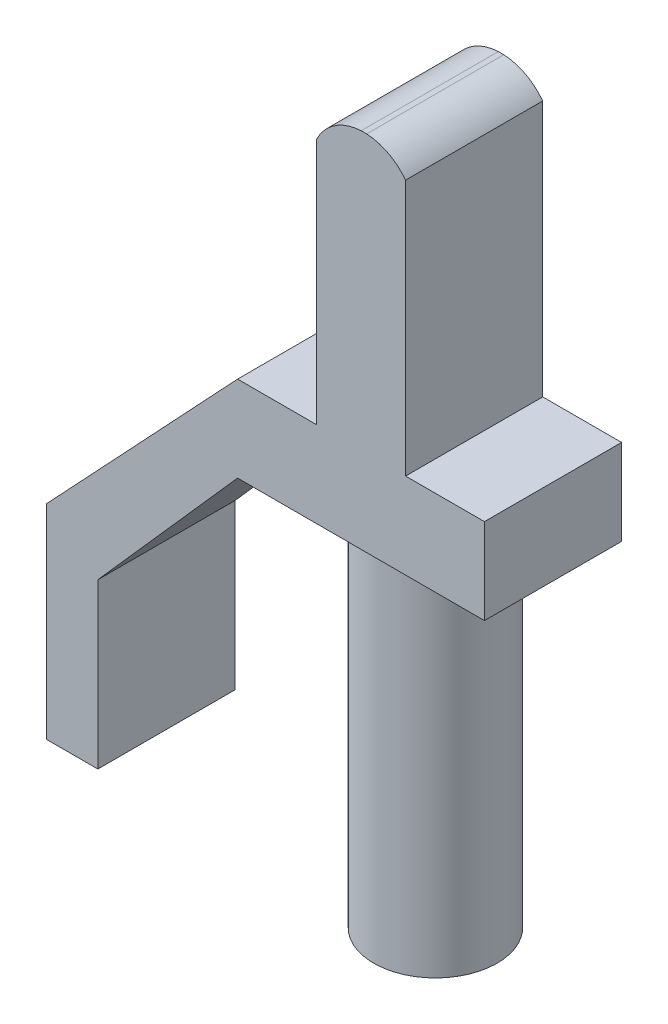
ISO-10303-21;
HEADER;
FILE_DESCRIPTION(('STEP AP214'),'2;1');
FILE_NAME('part.step','',(''),(''),'','','');
FILE_SCHEMA(('AUTOMOTIVE_DESIGN { 1 0 10303 214 1 1 1 1 }'));
ENDSEC;
DATA;
#1=APPLICATION_CONTEXT('core data for automotive mechanical design processes');
#2=APPLICATION_PROTOCOL_DEFINITION('international standard','automotive_design',2000,#1);
#3=PRODUCT_CONTEXT('',#1,'mechanical');
#4=PRODUCT('Part','Part','',(#3));
#5=PRODUCT_RELATED_PRODUCT_CATEGORY('part','',(#4));
#6=PRODUCT_DEFINITION_FORMATION('','',#4);
#7=PRODUCT_DEFINITION_CONTEXT('part definition',#1,'design');
#8=PRODUCT_DEFINITION('design','',#6,#7);
#9=PRODUCT_DEFINITION_SHAPE('','',#8);
#10=(LENGTH_UNIT() NAMED_UNIT(*) SI_UNIT(.MILLI.,.METRE.));
#11=(NAMED_UNIT(*) PLANE_ANGLE_UNIT() SI_UNIT($,.RADIAN.));
#12=(NAMED_UNIT(*) SI_UNIT($,.STERADIAN.) SOLID_ANGLE_UNIT());
#13=UNCERTAINTY_MEASURE_WITH_UNIT(LENGTH_MEASURE(1.E-05),#10,'distance_accuracy_value','');
#14=(GEOMETRIC_REPRESENTATION_CONTEXT(3) GLOBAL_UNCERTAINTY_ASSIGNED_CONTEXT((#13)) GLOBAL_UNIT_ASSIGNED_CONTEXT((#10,
#11,#12)) REPRESENTATION_CONTEXT('',''));
#15=CARTESIAN_POINT('',(0.,0.,0.));
#16=DIRECTION('',(0.,0.,1.));
#17=DIRECTION('',(1.,0.,0.));
#18=AXIS2_PLACEMENT_3D('',#15,#16,#17);
#19=CARTESIAN_POINT('',(-10.4086705744713,3.57642658835965,4.));
#20=DIRECTION('',(1.,0.,0.));
#21=DIRECTION('',(0.,0.,-1.));
#22=AXIS2_PLACEMENT_3D('',#19,#20,#21);
#23=PLANE('',#22);
#24=DIRECTION('',(0.,-1.,0.));
#25=VECTOR('',#24,1.);
#26=CARTESIAN_POINT('',(-10.4086705744713,3.57642658835965,0.));
#27=LINE('',#26,#25);
#28=CARTESIAN_POINT('',(-10.4086705744713,10.7764265883597,0.));
#29=VERTEX_POINT('',#28);
#30=CARTESIAN_POINT('',(-10.4086705744713,3.57996049213369,0.));
#31=VERTEX_POINT('',#30);
#32=EDGE_CURVE('E232',#29,#31,#27,.T.);
#33=ORIENTED_EDGE('',*,*,#32,.T.);
#34=DIRECTION('',(0.,0.,1.));
#35=VECTOR('',#34,1.);
#36=CARTESIAN_POINT('',(-10.4086705744713,3.57996049213369,4.));
#37=LINE('',#36,#35);
#38=CARTESIAN_POINT('',(-10.4086705744713,3.57996049213369,4.));
#39=VERTEX_POINT('',#38);
#40=EDGE_CURVE('E229',#31,#39,#37,.T.);
#41=ORIENTED_EDGE('',*,*,#40,.T.);
#42=DIRECTION('',(0.,-1.,0.));
#43=VECTOR('',#42,1.);
#44=CARTESIAN_POINT('',(-10.4086705744713,3.57642658835965,4.));
#45=LINE('',#44,#43);
#46=CARTESIAN_POINT('',(-10.4086705744713,10.7764265883597,4.));
#47=VERTEX_POINT('',#46);
#48=EDGE_CURVE('E233',#47,#39,#45,.T.);
#49=ORIENTED_EDGE('',*,*,#48,.F.);
#50=DIRECTION('',(0.,0.,-1.));
#51=VECTOR('',#50,1.);
#52=CARTESIAN_POINT('',(-10.4086705744713,10.7764265883597,4.));
#53=LINE('',#52,#51);
#54=EDGE_CURVE('E241',#47,#29,#53,.T.);
#55=ORIENTED_EDGE('',*,*,#54,.T.);
#56=EDGE_LOOP('',(#33,#41,#49,#55));
#57=FACE_BOUND('',#56,.T.);
#58=ADVANCED_FACE('F36',(#57),#23,.F.);
#59=CARTESIAN_POINT('',(-7.80867057447134,3.57642658835966,4.));
#60=DIRECTION('',(-1.,0.,0.));
#61=DIRECTION('',(0.,-1.,0.));
#62=AXIS2_PLACEMENT_3D('',#59,#60,#61);
#63=PLANE('',#62);
#64=DIRECTION('',(0.,1.,0.));
#65=VECTOR('',#64,1.);
#66=CARTESIAN_POINT('',(-7.80867057447134,3.57642658835966,4.));
#67=LINE('',#66,#65);
#68=CARTESIAN_POINT('',(-7.80867057447134,3.57996049213369,4.));
#69=VERTEX_POINT('',#68);
#70=CARTESIAN_POINT('',(-7.80867057447133,11.0550366767926,4.));
#71=VERTEX_POINT('',#70);
#72=EDGE_CURVE('E84',#69,#71,#67,.T.);
#73=ORIENTED_EDGE('',*,*,#72,.F.);
#74=DIRECTION('',(0.,0.,-1.));
#75=VECTOR('',#74,1.);
#76=CARTESIAN_POINT('',(-7.80867057447134,3.57996049213369,4.));
#77=LINE('',#76,#75);
#78=CARTESIAN_POINT('',(-7.80867057447134,3.57996049213369,0.));
#79=VERTEX_POINT('',#78);
#80=EDGE_CURVE('E220',#69,#79,#77,.T.);
#81=ORIENTED_EDGE('',*,*,#80,.T.);
#82=DIRECTION('',(0.,1.,0.));
#83=VECTOR('',#82,1.);
#84=CARTESIAN_POINT('',(-7.80867057447134,3.57642658835966,0.));
#85=LINE('',#84,#83);
#86=CARTESIAN_POINT('',(-7.80867057447133,11.0550366767926,0.));
#87=VERTEX_POINT('',#86);
#88=EDGE_CURVE('E244',#79,#87,#85,.T.);
#89=ORIENTED_EDGE('',*,*,#88,.T.);
#90=DIRECTION('',(0.,0.,-1.));
#91=VECTOR('',#90,1.);
#92=CARTESIAN_POINT('',(-7.80867057447133,11.0550366767926,4.));
#93=LINE('',#92,#91);
#94=EDGE_CURVE('E11',#71,#87,#93,.T.);
#95=ORIENTED_EDGE('',*,*,#94,.F.);
#96=EDGE_LOOP('',(#73,#81,#89,#95));
#97=FACE_BOUND('',#96,.T.);
#98=ADVANCED_FACE('F279',(#97),#63,.F.);
#99=CARTESIAN_POINT('',(-9.02437057447133,10.129040808734,4.));
#100=DIRECTION('',(0.,0.,-1.));
#101=DIRECTION('',(-1.,0.,0.));
#102=AXIS2_PLACEMENT_3D('',#99,#100,#101);
#103=CYLINDRICAL_SURFACE('',#102,1.52819986836195);
#104=CARTESIAN_POINT('',(-9.02437057447133,10.129040808734,0.));
#105=DIRECTION('',(0.,0.,1.));
#106=DIRECTION('',(-1.,0.,0.));
#107=AXIS2_PLACEMENT_3D('',#104,#105,#106);
#108=CIRCLE('',#107,1.52819986836195);
#109=CARTESIAN_POINT('',(-8.94482326092045,11.6551689365688,0.));
#110=VERTEX_POINT('',#109);
#111=EDGE_CURVE('E246',#87,#110,#108,.T.);
#112=ORIENTED_EDGE('',*,*,#111,.T.);
#113=DIRECTION('',(0.,0.,-1.));
#114=VECTOR('',#113,1.);
#115=CARTESIAN_POINT('',(-8.94482326092045,11.6551689365688,4.));
#116=LINE('',#115,#114);
#117=CARTESIAN_POINT('',(-8.94482326092045,11.6551689365688,4.));
#118=VERTEX_POINT('',#117);
#119=EDGE_CURVE('E43',#118,#110,#116,.T.);
#120=ORIENTED_EDGE('',*,*,#119,.F.);
#121=CARTESIAN_POINT('',(-9.02437057447133,10.129040808734,4.));
#122=DIRECTION('',(0.,0.,1.));
#123=DIRECTION('',(-1.,0.,0.));
#124=AXIS2_PLACEMENT_3D('',#121,#122,#123);
#125=CIRCLE('',#124,1.52819986836195);
#126=EDGE_CURVE('E236',#71,#118,#125,.T.);
#127=ORIENTED_EDGE('',*,*,#126,.F.);
#128=ORIENTED_EDGE('',*,*,#94,.T.);
#129=EDGE_LOOP('',(#112,#120,#127,#128));
#130=FACE_BOUND('',#129,.T.);
#131=ADVANCED_FACE('F275',(#130),#103,.T.);
#132=CARTESIAN_POINT('',(-9.10391788802218,11.6551689365688,4.));
#133=DIRECTION('',(0.,-1.,0.));
#134=DIRECTION('',(1.,0.,0.));
#135=AXIS2_PLACEMENT_3D('',#132,#133,#134);
#136=PLANE('',#135);
#137=DIRECTION('',(-1.,0.,0.));
#138=VECTOR('',#137,1.);
#139=CARTESIAN_POINT('',(-9.10391788802218,11.6551689365688,0.));
#140=LINE('',#139,#138);
#141=CARTESIAN_POINT('',(-9.10391788802218,11.6551689365688,0.));
#142=VERTEX_POINT('',#141);
#143=EDGE_CURVE('E248',#110,#142,#140,.T.);
#144=ORIENTED_EDGE('',*,*,#143,.T.);
#145=DIRECTION('',(0.,0.,-1.));
#146=VECTOR('',#145,1.);
#147=CARTESIAN_POINT('',(-9.10391788802218,11.6551689365688,4.));
#148=LINE('',#147,#146);
#149=CARTESIAN_POINT('',(-9.10391788802218,11.6551689365688,4.));
#150=VERTEX_POINT('',#149);
#151=EDGE_CURVE('E252',#150,#142,#148,.T.);
#152=ORIENTED_EDGE('',*,*,#151,.F.);
#153=DIRECTION('',(-1.,0.,0.));
#154=VECTOR('',#153,1.);
#155=CARTESIAN_POINT('',(-9.10391788802218,11.6551689365688,4.));
#156=LINE('',#155,#154);
#157=EDGE_CURVE('E238',#118,#150,#156,.T.);
#158=ORIENTED_EDGE('',*,*,#157,.F.);
#159=ORIENTED_EDGE('',*,*,#119,.T.);
#160=EDGE_LOOP('',(#144,#152,#158,#159));
#161=FACE_BOUND('',#160,.T.);
#162=ADVANCED_FACE('F258',(#161),#136,.F.);
#163=CARTESIAN_POINT('',(-9.02437057447133,10.129040808734,4.));
#164=DIRECTION('',(0.,0.,-1.));
#165=DIRECTION('',(-1.,0.,0.));
#166=AXIS2_PLACEMENT_3D('',#163,#164,#165);
#167=CYLINDRICAL_SURFACE('',#166,1.52819986836195);
#168=CARTESIAN_POINT('',(-9.02437057447133,10.129040808734,0.));
#169=DIRECTION('',(0.,0.,1.));
#170=DIRECTION('',(-1.,0.,0.));
#171=AXIS2_PLACEMENT_3D('',#168,#169,#170);
#172=CIRCLE('',#171,1.52819986836195);
#173=EDGE_CURVE('E79',#142,#29,#172,.T.);
#174=ORIENTED_EDGE('',*,*,#173,.T.);
#175=ORIENTED_EDGE('',*,*,#54,.F.);
#176=CARTESIAN_POINT('',(-9.02437057447133,10.129040808734,4.));
#177=DIRECTION('',(0.,0.,1.));
#178=DIRECTION('',(-1.,0.,0.));
#179=AXIS2_PLACEMENT_3D('',#176,#177,#178);
#180=CIRCLE('',#179,1.52819986836195);
#181=EDGE_CURVE('E58',#150,#47,#180,.T.);
#182=ORIENTED_EDGE('',*,*,#181,.F.);
#183=ORIENTED_EDGE('',*,*,#151,.T.);
#184=EDGE_LOOP('',(#174,#175,#182,#183));
#185=FACE_BOUND('',#184,.T.);
#186=ADVANCED_FACE('F266',(#185),#167,.T.);
#187=CARTESIAN_POINT('',(-9.02437057447133,10.129040808734,4.));
#188=DIRECTION('',(0.,0.,-1.));
#189=DIRECTION('',(-1.,0.,0.));
#190=AXIS2_PLACEMENT_3D('',#187,#188,#189);
#191=PLANE('',#190);
#192=ORIENTED_EDGE('',*,*,#48,.T.);
#193=DIRECTION('',(-1.,0.,0.));
#194=VECTOR('',#193,1.);
#195=CARTESIAN_POINT('',(-12.7086705744713,3.57996049213369,4.));
#196=LINE('',#195,#194);
#197=CARTESIAN_POINT('',(-12.7086705744713,3.57996049213369,4.));
#198=VERTEX_POINT('',#197);
#199=EDGE_CURVE('E217',#39,#198,#196,.T.);
#200=ORIENTED_EDGE('',*,*,#199,.T.);
#201=DIRECTION('',(-0.684533791682384,-0.728981130102102,0.));
#202=VECTOR('',#201,1.);
#203=CARTESIAN_POINT('',(-12.7086705744713,3.57996049213369,4.));
#204=LINE('',#203,#202);
#205=CARTESIAN_POINT('',(-18.2841262335639,-2.35751405855331,4.));
#206=VERTEX_POINT('',#205);
#207=EDGE_CURVE('E188',#198,#206,#204,.T.);
#208=ORIENTED_EDGE('',*,*,#207,.T.);
#209=DIRECTION('',(0.,-1.,0.));
#210=VECTOR('',#209,1.);
#211=CARTESIAN_POINT('',(-18.2841262335639,-2.35751405855331,4.));
#212=LINE('',#211,#210);
#213=CARTESIAN_POINT('',(-18.2841262335639,-8.30751405855331,4.));
#214=VERTEX_POINT('',#213);
#215=EDGE_CURVE('E150',#206,#214,#212,.T.);
#216=ORIENTED_EDGE('',*,*,#215,.T.);
#217=DIRECTION('',(1.,0.,0.));
#218=VECTOR('',#217,1.);
#219=CARTESIAN_POINT('',(-18.2841262335639,-8.30751405855331,4.));
#220=LINE('',#219,#218);
#221=CARTESIAN_POINT('',(-16.7841262335639,-8.30751405855331,4.));
#222=VERTEX_POINT('',#221);
#223=EDGE_CURVE('E192',#214,#222,#220,.T.);
#224=ORIENTED_EDGE('',*,*,#223,.T.);
#225=DIRECTION('',(0.,1.,0.));
#226=VECTOR('',#225,1.);
#227=CARTESIAN_POINT('',(-16.7841262335639,-8.30751405855331,4.));
#228=LINE('',#227,#226);
#229=CARTESIAN_POINT('',(-16.7841262335639,-3.5249924625135,4.));
#230=VERTEX_POINT('',#229);
#231=EDGE_CURVE('E176',#222,#230,#228,.T.);
#232=ORIENTED_EDGE('',*,*,#231,.T.);
#233=DIRECTION('',(0.662742037870614,0.748847775745583,0.));
#234=VECTOR('',#233,1.);
#235=CARTESIAN_POINT('',(-12.7086705744713,1.07996049213369,4.));
#236=LINE('',#235,#234);
#237=CARTESIAN_POINT('',(-12.7086705744713,1.07996049213369,4.));
#238=VERTEX_POINT('',#237);
#239=EDGE_CURVE('E173',#230,#238,#236,.T.);
#240=ORIENTED_EDGE('',*,*,#239,.T.);
#241=DIRECTION('',(1.,0.,0.));
#242=VECTOR('',#241,1.);
#243=CARTESIAN_POINT('',(-12.7086705744713,1.07996049213369,4.));
#244=LINE('',#243,#242);
#245=CARTESIAN_POINT('',(-5.50867057447133,1.07996049213369,4.));
#246=VERTEX_POINT('',#245);
#247=EDGE_CURVE('E199',#238,#246,#244,.T.);
#248=ORIENTED_EDGE('',*,*,#247,.T.);
#249=DIRECTION('',(0.,1.,0.));
#250=VECTOR('',#249,1.);
#251=CARTESIAN_POINT('',(-5.50867057447133,3.57996049213369,4.));
#252=LINE('',#251,#250);
#253=CARTESIAN_POINT('',(-5.50867057447133,3.57996049213369,4.));
#254=VERTEX_POINT('',#253);
#255=EDGE_CURVE('E215',#246,#254,#252,.T.);
#256=ORIENTED_EDGE('',*,*,#255,.T.);
#257=EDGE_CURVE('E50',#254,#69,#196,.T.);
#258=ORIENTED_EDGE('',*,*,#257,.T.);
#259=ORIENTED_EDGE('',*,*,#72,.T.);
#260=ORIENTED_EDGE('',*,*,#126,.T.);
#261=ORIENTED_EDGE('',*,*,#157,.T.);
#262=ORIENTED_EDGE('',*,*,#181,.T.);
#263=EDGE_LOOP('',(#192,#200,#208,#216,#224,#232,#240,#248,#256,#258,#259,#260,#261,#262));
#264=FACE_BOUND('',#263,.T.);
#265=ADVANCED_FACE('F268',(#264),#191,.F.);
#266=CARTESIAN_POINT('',(-9.02437057447133,10.129040808734,0.));
#267=DIRECTION('',(0.,0.,-1.));
#268=DIRECTION('',(-1.,0.,0.));
#269=AXIS2_PLACEMENT_3D('',#266,#267,#268);
#270=PLANE('',#269);
#271=ORIENTED_EDGE('',*,*,#88,.F.);
#272=DIRECTION('',(-1.,0.,0.));
#273=VECTOR('',#272,1.);
#274=CARTESIAN_POINT('',(-12.7086705744713,3.57996049213369,0.));
#275=LINE('',#274,#273);
#276=CARTESIAN_POINT('',(-5.50867057447133,3.57996049213369,0.));
#277=VERTEX_POINT('',#276);
#278=EDGE_CURVE('E210',#277,#79,#275,.T.);
#279=ORIENTED_EDGE('',*,*,#278,.F.);
#280=DIRECTION('',(0.,1.,0.));
#281=VECTOR('',#280,1.);
#282=CARTESIAN_POINT('',(-5.50867057447133,3.57996049213369,0.));
#283=LINE('',#282,#281);
#284=CARTESIAN_POINT('',(-5.50867057447133,1.07996049213369,0.));
#285=VERTEX_POINT('',#284);
#286=EDGE_CURVE('E206',#285,#277,#283,.T.);
#287=ORIENTED_EDGE('',*,*,#286,.F.);
#288=DIRECTION('',(1.,0.,0.));
#289=VECTOR('',#288,1.);
#290=CARTESIAN_POINT('',(-12.7086705744713,1.07996049213369,0.));
#291=LINE('',#290,#289);
#292=CARTESIAN_POINT('',(-12.7086705744713,1.07996049213369,0.));
#293=VERTEX_POINT('',#292);
#294=EDGE_CURVE('E203',#293,#285,#291,.T.);
#295=ORIENTED_EDGE('',*,*,#294,.F.);
#296=DIRECTION('',(0.662742037870614,0.748847775745583,0.));
#297=VECTOR('',#296,1.);
#298=CARTESIAN_POINT('',(-12.7086705744713,1.07996049213369,0.));
#299=LINE('',#298,#297);
#300=CARTESIAN_POINT('',(-16.7841262335639,-3.5249924625135,0.));
#301=VERTEX_POINT('',#300);
#302=EDGE_CURVE('E156',#301,#293,#299,.T.);
#303=ORIENTED_EDGE('',*,*,#302,.F.);
#304=DIRECTION('',(0.,1.,0.));
#305=VECTOR('',#304,1.);
#306=CARTESIAN_POINT('',(-16.7841262335639,-8.30751405855331,0.));
#307=LINE('',#306,#305);
#308=CARTESIAN_POINT('',(-16.7841262335639,-8.30751405855331,0.));
#309=VERTEX_POINT('',#308);
#310=EDGE_CURVE('E183',#309,#301,#307,.T.);
#311=ORIENTED_EDGE('',*,*,#310,.F.);
#312=DIRECTION('',(1.,0.,0.));
#313=VECTOR('',#312,1.);
#314=CARTESIAN_POINT('',(-18.2841262335639,-8.30751405855331,0.));
#315=LINE('',#314,#313);
#316=CARTESIAN_POINT('',(-18.2841262335639,-8.30751405855331,0.));
#317=VERTEX_POINT('',#316);
#318=EDGE_CURVE('E167',#317,#309,#315,.T.);
#319=ORIENTED_EDGE('',*,*,#318,.F.);
#320=DIRECTION('',(0.,-1.,0.));
#321=VECTOR('',#320,1.);
#322=CARTESIAN_POINT('',(-18.2841262335639,-2.35751405855331,0.));
#323=LINE('',#322,#321);
#324=CARTESIAN_POINT('',(-18.2841262335639,-2.35751405855331,0.));
#325=VERTEX_POINT('',#324);
#326=EDGE_CURVE('E148',#325,#317,#323,.T.);
#327=ORIENTED_EDGE('',*,*,#326,.F.);
#328=DIRECTION('',(-0.684533791682384,-0.728981130102102,0.));
#329=VECTOR('',#328,1.);
#330=CARTESIAN_POINT('',(-12.7086705744713,3.57996049213369,0.));
#331=LINE('',#330,#329);
#332=CARTESIAN_POINT('',(-12.7086705744713,3.57996049213369,0.));
#333=VERTEX_POINT('',#332);
#334=EDGE_CURVE('E164',#333,#325,#331,.T.);
#335=ORIENTED_EDGE('',*,*,#334,.F.);
#336=EDGE_CURVE('E209',#31,#333,#275,.T.);
#337=ORIENTED_EDGE('',*,*,#336,.F.);
#338=ORIENTED_EDGE('',*,*,#32,.F.);
#339=ORIENTED_EDGE('',*,*,#173,.F.);
#340=ORIENTED_EDGE('',*,*,#143,.F.);
#341=ORIENTED_EDGE('',*,*,#111,.F.);
#342=EDGE_LOOP('',(#271,#279,#287,#295,#303,#311,#319,#327,#335,#337,#338,#339,#340,#341));
#343=FACE_BOUND('',#342,.T.);
#344=ADVANCED_FACE('F162',(#343),#270,.T.);
#345=CARTESIAN_POINT('',(-12.7086705744713,3.57996049213369,0.));
#346=DIRECTION('',(0.,1.,0.));
#347=DIRECTION('',(0.,0.,1.));
#348=AXIS2_PLACEMENT_3D('',#345,#346,#347);
#349=PLANE('',#348);
#350=ORIENTED_EDGE('',*,*,#40,.F.);
#351=ORIENTED_EDGE('',*,*,#336,.T.);
#352=DIRECTION('',(0.,0.,1.));
#353=VECTOR('',#352,1.);
#354=CARTESIAN_POINT('',(-12.7086705744713,3.57996049213369,0.));
#355=LINE('',#354,#353);
#356=EDGE_CURVE('E172',#333,#198,#355,.T.);
#357=ORIENTED_EDGE('',*,*,#356,.T.);
#358=ORIENTED_EDGE('',*,*,#199,.F.);
#359=EDGE_LOOP('',(#350,#351,#357,#358));
#360=FACE_BOUND('',#359,.T.);
#361=ADVANCED_FACE('F289',(#360),#349,.T.);
#362=ORIENTED_EDGE('',*,*,#80,.F.);
#363=ORIENTED_EDGE('',*,*,#257,.F.);
#364=DIRECTION('',(0.,0.,1.));
#365=VECTOR('',#364,1.);
#366=CARTESIAN_POINT('',(-5.50867057447133,3.57996049213369,0.));
#367=LINE('',#366,#365);
#368=EDGE_CURVE('E221',#277,#254,#367,.T.);
#369=ORIENTED_EDGE('',*,*,#368,.F.);
#370=ORIENTED_EDGE('',*,*,#278,.T.);
#371=EDGE_LOOP('',(#362,#363,#369,#370));
#372=FACE_BOUND('',#371,.T.);
#373=ADVANCED_FACE('F291',(#372),#349,.T.);
#374=CARTESIAN_POINT('',(-5.50867057447133,3.57996049213369,0.));
#375=DIRECTION('',(1.,0.,0.));
#376=DIRECTION('',(0.,0.,-1.));
#377=AXIS2_PLACEMENT_3D('',#374,#375,#376);
#378=PLANE('',#377);
#379=ORIENTED_EDGE('',*,*,#255,.F.);
#380=DIRECTION('',(0.,0.,1.));
#381=VECTOR('',#380,1.);
#382=CARTESIAN_POINT('',(-5.50867057447133,1.07996049213369,0.));
#383=LINE('',#382,#381);
#384=EDGE_CURVE('E223',#285,#246,#383,.T.);
#385=ORIENTED_EDGE('',*,*,#384,.F.);
#386=ORIENTED_EDGE('',*,*,#286,.T.);
#387=ORIENTED_EDGE('',*,*,#368,.T.);
#388=EDGE_LOOP('',(#379,#385,#386,#387));
#389=FACE_BOUND('',#388,.T.);
#390=ADVANCED_FACE('F297',(#389),#378,.T.);
#391=CARTESIAN_POINT('',(-12.7086705744713,1.07996049213369,0.));
#392=DIRECTION('',(0.,-1.,0.));
#393=DIRECTION('',(0.,0.,-1.));
#394=AXIS2_PLACEMENT_3D('',#391,#392,#393);
#395=PLANE('',#394);
#396=CARTESIAN_POINT('',(-9.11835401547023,1.07996049213369,1.82));
#397=DIRECTION('',(0.,-1.,0.));
#398=DIRECTION('',(0.,0.,-1.));
#399=AXIS2_PLACEMENT_3D('',#396,#397,#398);
#400=CIRCLE('',#399,1.8);
#401=CARTESIAN_POINT('',(-9.11835401547023,1.07996049213369,0.0200000000000003));
#402=VERTEX_POINT('',#401);
#403=EDGE_CURVE('E179',#402,#402,#400,.T.);
#404=ORIENTED_EDGE('',*,*,#403,.F.);
#405=EDGE_LOOP('',(#404));
#406=FACE_BOUND('',#405,.T.);
#407=ORIENTED_EDGE('',*,*,#247,.F.);
#408=DIRECTION('',(0.,0.,1.));
#409=VECTOR('',#408,1.);
#410=CARTESIAN_POINT('',(-12.7086705744713,1.07996049213369,0.));
#411=LINE('',#410,#409);
#412=EDGE_CURVE('E212',#293,#238,#411,.T.);
#413=ORIENTED_EDGE('',*,*,#412,.F.);
#414=ORIENTED_EDGE('',*,*,#294,.T.);
#415=ORIENTED_EDGE('',*,*,#384,.T.);
#416=EDGE_LOOP('',(#407,#413,#414,#415));
#417=FACE_BOUND('',#416,.T.);
#418=ADVANCED_FACE('F304',(#406,#417),#395,.T.);
#419=CARTESIAN_POINT('',(-12.7086705744713,1.07996049213369,0.));
#420=DIRECTION('',(0.748847775745583,-0.662742037870614,0.));
#421=DIRECTION('',(0.662742037870613,0.748847775745583,0.));
#422=AXIS2_PLACEMENT_3D('',#419,#420,#421);
#423=PLANE('',#422);
#424=ORIENTED_EDGE('',*,*,#239,.F.);
#425=DIRECTION('',(0.,0.,1.));
#426=VECTOR('',#425,1.);
#427=CARTESIAN_POINT('',(-16.7841262335639,-3.5249924625135,0.));
#428=LINE('',#427,#426);
#429=EDGE_CURVE('E197',#301,#230,#428,.T.);
#430=ORIENTED_EDGE('',*,*,#429,.F.);
#431=ORIENTED_EDGE('',*,*,#302,.T.);
#432=ORIENTED_EDGE('',*,*,#412,.T.);
#433=EDGE_LOOP('',(#424,#430,#431,#432));
#434=FACE_BOUND('',#433,.T.);
#435=ADVANCED_FACE('F307',(#434),#423,.T.);
#436=CARTESIAN_POINT('',(-16.7841262335639,-8.30751405855331,0.));
#437=DIRECTION('',(1.,0.,0.));
#438=DIRECTION('',(0.,0.,-1.));
#439=AXIS2_PLACEMENT_3D('',#436,#437,#438);
#440=PLANE('',#439);
#441=ORIENTED_EDGE('',*,*,#231,.F.);
#442=DIRECTION('',(0.,0.,1.));
#443=VECTOR('',#442,1.);
#444=CARTESIAN_POINT('',(-16.7841262335639,-8.30751405855331,0.));
#445=LINE('',#444,#443);
#446=EDGE_CURVE('E200',#309,#222,#445,.T.);
#447=ORIENTED_EDGE('',*,*,#446,.F.);
#448=ORIENTED_EDGE('',*,*,#310,.T.);
#449=ORIENTED_EDGE('',*,*,#429,.T.);
#450=EDGE_LOOP('',(#441,#447,#448,#449));
#451=FACE_BOUND('',#450,.T.);
#452=ADVANCED_FACE('F312',(#451),#440,.T.);
#453=CARTESIAN_POINT('',(-18.2841262335639,-8.30751405855331,0.));
#454=DIRECTION('',(0.,-1.,0.));
#455=DIRECTION('',(0.,0.,-1.));
#456=AXIS2_PLACEMENT_3D('',#453,#454,#455);
#457=PLANE('',#456);
#458=ORIENTED_EDGE('',*,*,#223,.F.);
#459=DIRECTION('',(0.,0.,1.));
#460=VECTOR('',#459,1.);
#461=CARTESIAN_POINT('',(-18.2841262335639,-8.30751405855331,0.));
#462=LINE('',#461,#460);
#463=EDGE_CURVE('E155',#317,#214,#462,.T.);
#464=ORIENTED_EDGE('',*,*,#463,.F.);
#465=ORIENTED_EDGE('',*,*,#318,.T.);
#466=ORIENTED_EDGE('',*,*,#446,.T.);
#467=EDGE_LOOP('',(#458,#464,#465,#466));
#468=FACE_BOUND('',#467,.T.);
#469=ADVANCED_FACE('F328',(#468),#457,.T.);
#470=CARTESIAN_POINT('',(-18.2841262335639,-2.35751405855331,0.));
#471=DIRECTION('',(-1.,0.,0.));
#472=DIRECTION('',(0.,0.,1.));
#473=AXIS2_PLACEMENT_3D('',#470,#471,#472);
#474=PLANE('',#473);
#475=ORIENTED_EDGE('',*,*,#215,.F.);
#476=DIRECTION('',(0.,0.,1.));
#477=VECTOR('',#476,1.);
#478=CARTESIAN_POINT('',(-18.2841262335639,-2.35751405855331,0.));
#479=LINE('',#478,#477);
#480=EDGE_CURVE('E145',#325,#206,#479,.T.);
#481=ORIENTED_EDGE('',*,*,#480,.F.);
#482=ORIENTED_EDGE('',*,*,#326,.T.);
#483=ORIENTED_EDGE('',*,*,#463,.T.);
#484=EDGE_LOOP('',(#475,#481,#482,#483));
#485=FACE_BOUND('',#484,.T.);
#486=ADVANCED_FACE('F147',(#485),#474,.T.);
#487=CARTESIAN_POINT('',(-12.7086705744713,3.57996049213369,0.));
#488=DIRECTION('',(-0.728981130102102,0.684533791682384,0.));
#489=DIRECTION('',(-0.684533791682384,-0.728981130102102,0.));
#490=AXIS2_PLACEMENT_3D('',#487,#488,#489);
#491=PLANE('',#490);
#492=ORIENTED_EDGE('',*,*,#207,.F.);
#493=ORIENTED_EDGE('',*,*,#356,.F.);
#494=ORIENTED_EDGE('',*,*,#334,.T.);
#495=ORIENTED_EDGE('',*,*,#480,.T.);
#496=EDGE_LOOP('',(#492,#493,#494,#495));
#497=FACE_BOUND('',#496,.T.);
#498=ADVANCED_FACE('F170',(#497),#491,.T.);
#499=CARTESIAN_POINT('',(-9.11835401547023,-9.57003950786631,1.82));
#500=DIRECTION('',(0.,1.,0.));
#501=DIRECTION('',(0.,0.,1.));
#502=AXIS2_PLACEMENT_3D('',#499,#500,#501);
#503=CYLINDRICAL_SURFACE('',#502,1.8);
#504=CARTESIAN_POINT('',(-9.11835401547023,-9.57003950786631,1.82));
#505=DIRECTION('',(0.,-1.,0.));
#506=DIRECTION('',(0.,0.,-1.));
#507=AXIS2_PLACEMENT_3D('',#504,#505,#506);
#508=CIRCLE('',#507,1.8);
#509=CARTESIAN_POINT('',(-9.11835401547023,-9.57003950786631,0.0200000000000003));
#510=VERTEX_POINT('',#509);
#511=EDGE_CURVE('E190',#510,#510,#508,.T.);
#512=ORIENTED_EDGE('',*,*,#511,.F.);
#513=EDGE_LOOP('',(#512));
#514=FACE_BOUND('',#513,.T.);
#515=ORIENTED_EDGE('',*,*,#403,.T.);
#516=EDGE_LOOP('',(#515));
#517=FACE_BOUND('',#516,.T.);
#518=ADVANCED_FACE('F337',(#514,#517),#503,.T.);
#519=CARTESIAN_POINT('',(-9.11835401547023,-9.57003950786631,1.82));
#520=DIRECTION('',(0.,-1.,0.));
#521=DIRECTION('',(0.,0.,-1.));
#522=AXIS2_PLACEMENT_3D('',#519,#520,#521);
#523=PLANE('',#522);
#524=ORIENTED_EDGE('',*,*,#511,.T.);
#525=EDGE_LOOP('',(#524));
#526=FACE_BOUND('',#525,.T.);
#527=ADVANCED_FACE('F340',(#526),#523,.T.);
#528=CLOSED_SHELL('',(#58,#98,#131,#162,#186,#265,#344,#361,#373,#390,#418,#435,#452,#469,#486,
#498,#518,#527));
#529=MANIFOLD_SOLID_BREP('B2',#528);
#530=ADVANCED_BREP_SHAPE_REPRESENTATION('',(#18,#529),#14);
#531=SHAPE_DEFINITION_REPRESENTATION(#9,#530);
ENDSEC;
END-ISO-10303-21;
